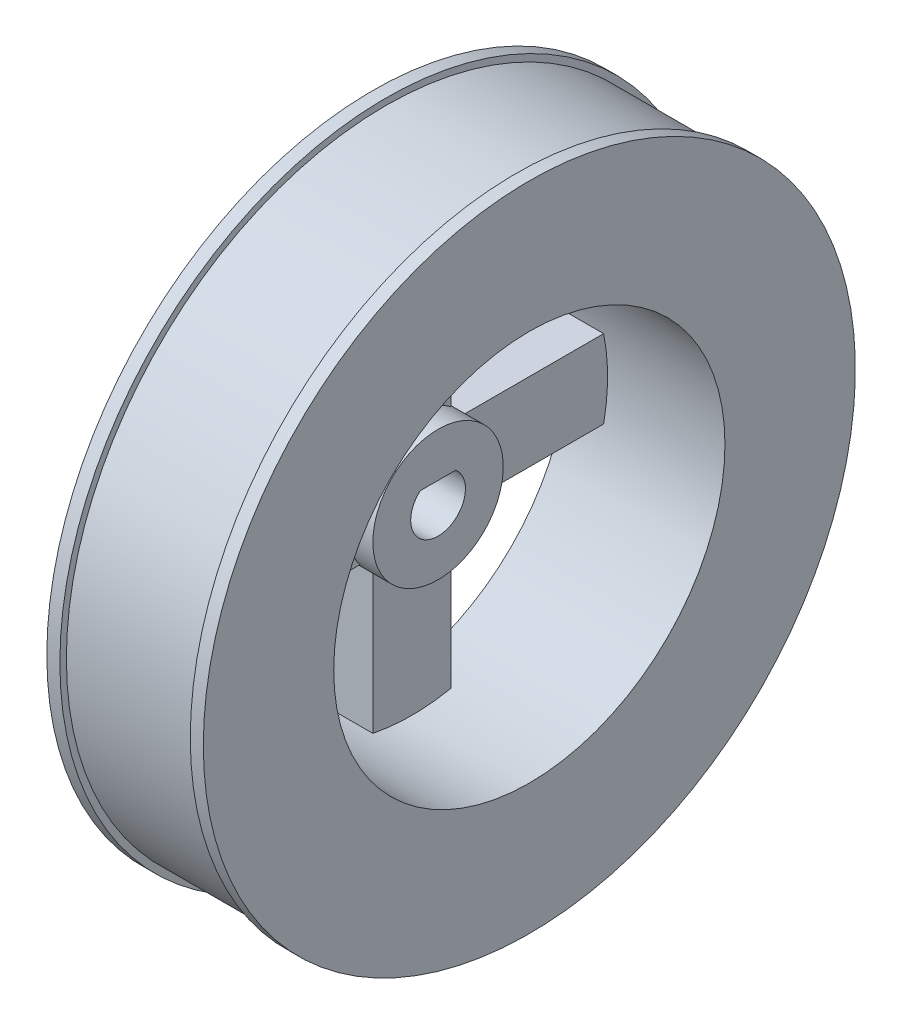
ISO-10303-21;
HEADER;
FILE_DESCRIPTION(('STEP AP214'),'2;1');
FILE_NAME('part.step','',(''),(''),'','','');
FILE_SCHEMA(('AUTOMOTIVE_DESIGN { 1 0 10303 214 1 1 1 1 }'));
ENDSEC;
DATA;
#1=APPLICATION_CONTEXT('core data for automotive mechanical design processes');
#2=APPLICATION_PROTOCOL_DEFINITION('international standard','automotive_design',2000,#1);
#3=PRODUCT_CONTEXT('',#1,'mechanical');
#4=PRODUCT('Part','Part','',(#3));
#5=PRODUCT_RELATED_PRODUCT_CATEGORY('part','',(#4));
#6=PRODUCT_DEFINITION_FORMATION('','',#4);
#7=PRODUCT_DEFINITION_CONTEXT('part definition',#1,'design');
#8=PRODUCT_DEFINITION('design','',#6,#7);
#9=PRODUCT_DEFINITION_SHAPE('','',#8);
#10=(LENGTH_UNIT() NAMED_UNIT(*) SI_UNIT(.MILLI.,.METRE.));
#11=(NAMED_UNIT(*) PLANE_ANGLE_UNIT() SI_UNIT($,.RADIAN.));
#12=(NAMED_UNIT(*) SI_UNIT($,.STERADIAN.) SOLID_ANGLE_UNIT());
#13=UNCERTAINTY_MEASURE_WITH_UNIT(LENGTH_MEASURE(1.E-05),#10,'distance_accuracy_value','');
#14=(GEOMETRIC_REPRESENTATION_CONTEXT(3) GLOBAL_UNCERTAINTY_ASSIGNED_CONTEXT((#13)) GLOBAL_UNIT_ASSIGNED_CONTEXT((#10,
#11,#12)) REPRESENTATION_CONTEXT('',''));
#15=CARTESIAN_POINT('',(0.,0.,0.));
#16=DIRECTION('',(0.,0.,1.));
#17=DIRECTION('',(1.,0.,0.));
#18=AXIS2_PLACEMENT_3D('',#15,#16,#17);
#19=CARTESIAN_POINT('',(0.,0.,0.));
#20=DIRECTION('',(-1.,0.,0.));
#21=DIRECTION('',(0.,0.,1.));
#22=AXIS2_PLACEMENT_3D('',#19,#20,#21);
#23=CYLINDRICAL_SURFACE('',#22,15.);
#24=CARTESIAN_POINT('',(6.00000000000001,0.,0.));
#25=DIRECTION('',(-1.,0.,0.));
#26=DIRECTION('',(0.,0.,1.));
#27=AXIS2_PLACEMENT_3D('',#24,#25,#26);
#28=CIRCLE('',#27,15.);
#29=CARTESIAN_POINT('',(6.00000000000001,0.,15.));
#30=VERTEX_POINT('',#29);
#31=EDGE_CURVE('E360',#30,#30,#28,.T.);
#32=ORIENTED_EDGE('',*,*,#31,.F.);
#33=EDGE_LOOP('',(#32));
#34=FACE_BOUND('',#33,.T.);
#35=DIRECTION('',(-1.,0.,0.));
#36=VECTOR('',#35,1.);
#37=CARTESIAN_POINT('',(-3.00000000000001,3.00000000000016,14.696938456699));
#38=LINE('',#37,#36);
#39=CARTESIAN_POINT('',(-3.00000000000001,3.00000000000016,14.696938456699));
#40=VERTEX_POINT('',#39);
#41=CARTESIAN_POINT('',(-6.00000000000001,3.00000000000016,14.696938456699));
#42=VERTEX_POINT('',#41);
#43=EDGE_CURVE('E178',#40,#42,#38,.T.);
#44=ORIENTED_EDGE('',*,*,#43,.T.);
#45=CARTESIAN_POINT('',(-6.00000000000001,0.,0.));
#46=DIRECTION('',(-1.,0.,0.));
#47=DIRECTION('',(0.,0.,1.));
#48=AXIS2_PLACEMENT_3D('',#45,#46,#47);
#49=CIRCLE('',#48,15.);
#50=CARTESIAN_POINT('',(-6.00000000000001,14.6969384566991,3.));
#51=VERTEX_POINT('',#50);
#52=EDGE_CURVE('E364',#42,#51,#49,.T.);
#53=ORIENTED_EDGE('',*,*,#52,.T.);
#54=DIRECTION('',(-1.,0.,0.));
#55=VECTOR('',#54,1.);
#56=CARTESIAN_POINT('',(-3.00000000000001,14.6969384566991,3.));
#57=LINE('',#56,#55);
#58=CARTESIAN_POINT('',(-3.00000000000001,14.6969384566991,3.));
#59=VERTEX_POINT('',#58);
#60=EDGE_CURVE('E328',#59,#51,#57,.T.);
#61=ORIENTED_EDGE('',*,*,#60,.F.);
#62=CARTESIAN_POINT('',(-3.00000000000001,0.,0.));
#63=DIRECTION('',(1.,0.,0.));
#64=DIRECTION('',(0.,0.,1.));
#65=AXIS2_PLACEMENT_3D('',#62,#63,#64);
#66=CIRCLE('',#65,15.);
#67=CARTESIAN_POINT('',(-3.00000000000001,14.6969384566991,-3.));
#68=VERTEX_POINT('',#67);
#69=EDGE_CURVE('E311',#68,#59,#66,.T.);
#70=ORIENTED_EDGE('',*,*,#69,.F.);
#71=DIRECTION('',(-1.,0.,0.));
#72=VECTOR('',#71,1.);
#73=CARTESIAN_POINT('',(-3.00000000000001,14.6969384566991,-3.));
#74=LINE('',#73,#72);
#75=CARTESIAN_POINT('',(-6.00000000000001,14.6969384566991,-3.));
#76=VERTEX_POINT('',#75);
#77=EDGE_CURVE('E332',#68,#76,#74,.T.);
#78=ORIENTED_EDGE('',*,*,#77,.T.);
#79=CARTESIAN_POINT('',(-6.00000000000001,2.99999999999994,-14.6969384566991));
#80=VERTEX_POINT('',#79);
#81=EDGE_CURVE('E365',#76,#80,#49,.T.);
#82=ORIENTED_EDGE('',*,*,#81,.T.);
#83=DIRECTION('',(-1.,0.,0.));
#84=VECTOR('',#83,1.);
#85=CARTESIAN_POINT('',(-3.00000000000001,2.99999999999995,-14.6969384566991));
#86=LINE('',#85,#84);
#87=CARTESIAN_POINT('',(-3.00000000000001,2.99999999999995,-14.6969384566991));
#88=VERTEX_POINT('',#87);
#89=EDGE_CURVE('E266',#88,#80,#86,.T.);
#90=ORIENTED_EDGE('',*,*,#89,.F.);
#91=CARTESIAN_POINT('',(-3.00000000000001,0.,0.));
#92=DIRECTION('',(1.,0.,0.));
#93=DIRECTION('',(0.,1.,0.));
#94=AXIS2_PLACEMENT_3D('',#91,#92,#93);
#95=CIRCLE('',#94,15.);
#96=CARTESIAN_POINT('',(-3.00000000000001,-3.00000000000005,-14.6969384566991));
#97=VERTEX_POINT('',#96);
#98=EDGE_CURVE('E250',#97,#88,#95,.T.);
#99=ORIENTED_EDGE('',*,*,#98,.F.);
#100=DIRECTION('',(-1.,0.,0.));
#101=VECTOR('',#100,1.);
#102=CARTESIAN_POINT('',(-3.00000000000001,-3.00000000000006,-14.6969384566991));
#103=LINE('',#102,#101);
#104=CARTESIAN_POINT('',(-6.00000000000001,-3.00000000000006,-14.6969384566991));
#105=VERTEX_POINT('',#104);
#106=EDGE_CURVE('E270',#97,#105,#103,.T.);
#107=ORIENTED_EDGE('',*,*,#106,.T.);
#108=CARTESIAN_POINT('',(-6.00000000000001,-14.6969384566991,-3.));
#109=VERTEX_POINT('',#108);
#110=EDGE_CURVE('E369',#105,#109,#49,.T.);
#111=ORIENTED_EDGE('',*,*,#110,.T.);
#112=DIRECTION('',(-1.,0.,0.));
#113=VECTOR('',#112,1.);
#114=CARTESIAN_POINT('',(-3.00000000000001,-14.6969384566991,-3.));
#115=LINE('',#114,#113);
#116=CARTESIAN_POINT('',(-3.00000000000001,-14.6969384566991,-3.));
#117=VERTEX_POINT('',#116);
#118=EDGE_CURVE('E229',#117,#109,#115,.T.);
#119=ORIENTED_EDGE('',*,*,#118,.F.);
#120=CARTESIAN_POINT('',(-3.00000000000001,0.,0.));
#121=DIRECTION('',(1.,0.,0.));
#122=DIRECTION('',(0.,0.,-1.));
#123=AXIS2_PLACEMENT_3D('',#120,#121,#122);
#124=CIRCLE('',#123,15.);
#125=CARTESIAN_POINT('',(-3.00000000000001,-14.6969384566991,3.));
#126=VERTEX_POINT('',#125);
#127=EDGE_CURVE('E216',#126,#117,#124,.T.);
#128=ORIENTED_EDGE('',*,*,#127,.F.);
#129=DIRECTION('',(-1.,0.,0.));
#130=VECTOR('',#129,1.);
#131=CARTESIAN_POINT('',(-3.00000000000001,-14.6969384566991,3.));
#132=LINE('',#131,#130);
#133=CARTESIAN_POINT('',(-6.00000000000001,-14.6969384566991,3.));
#134=VERTEX_POINT('',#133);
#135=EDGE_CURVE('E233',#126,#134,#132,.T.);
#136=ORIENTED_EDGE('',*,*,#135,.T.);
#137=CARTESIAN_POINT('',(-6.00000000000001,-2.99999999999984,14.6969384566991));
#138=VERTEX_POINT('',#137);
#139=EDGE_CURVE('E449',#134,#138,#49,.T.);
#140=ORIENTED_EDGE('',*,*,#139,.T.);
#141=DIRECTION('',(-1.,0.,0.));
#142=VECTOR('',#141,1.);
#143=CARTESIAN_POINT('',(-3.00000000000001,-2.99999999999984,14.6969384566991));
#144=LINE('',#143,#142);
#145=CARTESIAN_POINT('',(-3.00000000000001,-2.99999999999984,14.6969384566991));
#146=VERTEX_POINT('',#145);
#147=EDGE_CURVE('E68',#146,#138,#144,.T.);
#148=ORIENTED_EDGE('',*,*,#147,.F.);
#149=CARTESIAN_POINT('',(-3.00000000000001,0.,0.));
#150=DIRECTION('',(1.,0.,0.));
#151=DIRECTION('',(0.,-1.,0.));
#152=AXIS2_PLACEMENT_3D('',#149,#150,#151);
#153=CIRCLE('',#152,15.);
#154=EDGE_CURVE('E63',#40,#146,#153,.T.);
#155=ORIENTED_EDGE('',*,*,#154,.F.);
#156=EDGE_LOOP('',(#44,#53,#61,#70,#78,#82,#90,#99,#107,#111,#119,#128,#136,#140,#148,#155));
#157=FACE_BOUND('',#156,.T.);
#158=ADVANCED_FACE('F47',(#34,#157),#23,.F.);
#159=CARTESIAN_POINT('',(0.,0.,0.));
#160=DIRECTION('',(-1.,0.,0.));
#161=DIRECTION('',(0.,0.,1.));
#162=AXIS2_PLACEMENT_3D('',#159,#160,#161);
#163=CYLINDRICAL_SURFACE('',#162,5.);
#164=CARTESIAN_POINT('',(-0.999999999999997,0.,0.));
#165=DIRECTION('',(-1.,0.,0.));
#166=DIRECTION('',(0.,0.,1.));
#167=AXIS2_PLACEMENT_3D('',#164,#165,#166);
#168=CIRCLE('',#167,5.);
#169=CARTESIAN_POINT('',(-0.999999999999997,0.,5.));
#170=VERTEX_POINT('',#169);
#171=EDGE_CURVE('E296',#170,#170,#168,.T.);
#172=ORIENTED_EDGE('',*,*,#171,.T.);
#173=EDGE_LOOP('',(#172));
#174=FACE_BOUND('',#173,.T.);
#175=DIRECTION('',(-1.,0.,0.));
#176=VECTOR('',#175,1.);
#177=CARTESIAN_POINT('',(-3.00000000000001,3.00000000000004,3.99999999999997));
#178=LINE('',#177,#176);
#179=CARTESIAN_POINT('',(-3.00000000000001,3.00000000000004,3.99999999999997));
#180=VERTEX_POINT('',#179);
#181=CARTESIAN_POINT('',(-6.,3.00000000000004,3.99999999999997));
#182=VERTEX_POINT('',#181);
#183=EDGE_CURVE('E176',#180,#182,#178,.T.);
#184=ORIENTED_EDGE('',*,*,#183,.F.);
#185=CARTESIAN_POINT('',(-3.00000000000001,0.,0.));
#186=DIRECTION('',(-1.,0.,0.));
#187=DIRECTION('',(0.,1.,0.));
#188=AXIS2_PLACEMENT_3D('',#185,#186,#187);
#189=CIRCLE('',#188,5.);
#190=CARTESIAN_POINT('',(-3.00000000000001,-2.99999999999996,4.00000000000003));
#191=VERTEX_POINT('',#190);
#192=EDGE_CURVE('E181',#191,#180,#189,.T.);
#193=ORIENTED_EDGE('',*,*,#192,.F.);
#194=DIRECTION('',(-1.,0.,0.));
#195=VECTOR('',#194,1.);
#196=CARTESIAN_POINT('',(-3.00000000000001,-2.99999999999996,4.00000000000003));
#197=LINE('',#196,#195);
#198=CARTESIAN_POINT('',(-6.00000000000001,-2.99999999999996,4.00000000000003));
#199=VERTEX_POINT('',#198);
#200=EDGE_CURVE('E439',#191,#199,#197,.T.);
#201=ORIENTED_EDGE('',*,*,#200,.T.);
#202=CARTESIAN_POINT('',(-6.,0.,0.));
#203=DIRECTION('',(-1.,0.,0.));
#204=DIRECTION('',(0.,0.,1.));
#205=AXIS2_PLACEMENT_3D('',#202,#203,#204);
#206=CIRCLE('',#205,5.);
#207=CARTESIAN_POINT('',(-6.,-4.,3.));
#208=VERTEX_POINT('',#207);
#209=EDGE_CURVE('E451',#208,#199,#206,.T.);
#210=ORIENTED_EDGE('',*,*,#209,.F.);
#211=DIRECTION('',(-1.,0.,0.));
#212=VECTOR('',#211,1.);
#213=CARTESIAN_POINT('',(-3.00000000000001,-4.,3.));
#214=LINE('',#213,#212);
#215=CARTESIAN_POINT('',(-3.00000000000001,-4.,3.));
#216=VERTEX_POINT('',#215);
#217=EDGE_CURVE('E237',#216,#208,#214,.T.);
#218=ORIENTED_EDGE('',*,*,#217,.F.);
#219=CARTESIAN_POINT('',(-3.00000000000001,0.,0.));
#220=DIRECTION('',(-1.,0.,0.));
#221=DIRECTION('',(0.,0.,1.));
#222=AXIS2_PLACEMENT_3D('',#219,#220,#221);
#223=CIRCLE('',#222,5.);
#224=CARTESIAN_POINT('',(-3.00000000000001,-4.,-3.));
#225=VERTEX_POINT('',#224);
#226=EDGE_CURVE('E208',#225,#216,#223,.T.);
#227=ORIENTED_EDGE('',*,*,#226,.F.);
#228=DIRECTION('',(-1.,0.,0.));
#229=VECTOR('',#228,1.);
#230=CARTESIAN_POINT('',(-3.00000000000001,-4.,-3.));
#231=LINE('',#230,#229);
#232=CARTESIAN_POINT('',(-6.00000000000001,-4.,-3.));
#233=VERTEX_POINT('',#232);
#234=EDGE_CURVE('E222',#225,#233,#231,.T.);
#235=ORIENTED_EDGE('',*,*,#234,.T.);
#236=CARTESIAN_POINT('',(-6.,-3.00000000000002,-3.99999999999999));
#237=VERTEX_POINT('',#236);
#238=EDGE_CURVE('E297',#237,#233,#206,.T.);
#239=ORIENTED_EDGE('',*,*,#238,.F.);
#240=DIRECTION('',(-1.,0.,0.));
#241=VECTOR('',#240,1.);
#242=CARTESIAN_POINT('',(-3.00000000000001,-3.00000000000002,-3.99999999999999));
#243=LINE('',#242,#241);
#244=CARTESIAN_POINT('',(-3.00000000000001,-3.00000000000002,-3.99999999999999));
#245=VERTEX_POINT('',#244);
#246=EDGE_CURVE('E274',#245,#237,#243,.T.);
#247=ORIENTED_EDGE('',*,*,#246,.F.);
#248=CARTESIAN_POINT('',(-3.00000000000001,0.,0.));
#249=DIRECTION('',(-1.,0.,0.));
#250=DIRECTION('',(0.,-1.,0.));
#251=AXIS2_PLACEMENT_3D('',#248,#249,#250);
#252=CIRCLE('',#251,5.);
#253=CARTESIAN_POINT('',(-3.00000000000001,2.99999999999998,-4.00000000000001));
#254=VERTEX_POINT('',#253);
#255=EDGE_CURVE('E241',#254,#245,#252,.T.);
#256=ORIENTED_EDGE('',*,*,#255,.F.);
#257=DIRECTION('',(-1.,0.,0.));
#258=VECTOR('',#257,1.);
#259=CARTESIAN_POINT('',(-3.00000000000001,2.99999999999998,-4.00000000000001));
#260=LINE('',#259,#258);
#261=CARTESIAN_POINT('',(-6.00000000000001,2.99999999999998,-4.00000000000001));
#262=VERTEX_POINT('',#261);
#263=EDGE_CURVE('E257',#254,#262,#260,.T.);
#264=ORIENTED_EDGE('',*,*,#263,.T.);
#265=CARTESIAN_POINT('',(-6.,4.,-3.));
#266=VERTEX_POINT('',#265);
#267=EDGE_CURVE('E292',#266,#262,#206,.T.);
#268=ORIENTED_EDGE('',*,*,#267,.F.);
#269=DIRECTION('',(-1.,0.,0.));
#270=VECTOR('',#269,1.);
#271=CARTESIAN_POINT('',(-3.00000000000001,4.,-3.));
#272=LINE('',#271,#270);
#273=CARTESIAN_POINT('',(-3.00000000000001,4.,-3.));
#274=VERTEX_POINT('',#273);
#275=EDGE_CURVE('E336',#274,#266,#272,.T.);
#276=ORIENTED_EDGE('',*,*,#275,.F.);
#277=CARTESIAN_POINT('',(-3.00000000000001,0.,0.));
#278=DIRECTION('',(-1.,0.,0.));
#279=DIRECTION('',(0.,0.,-1.));
#280=AXIS2_PLACEMENT_3D('',#277,#278,#279);
#281=CIRCLE('',#280,5.);
#282=CARTESIAN_POINT('',(-3.00000000000001,4.,3.));
#283=VERTEX_POINT('',#282);
#284=EDGE_CURVE('E302',#283,#274,#281,.T.);
#285=ORIENTED_EDGE('',*,*,#284,.F.);
#286=DIRECTION('',(-1.,0.,0.));
#287=VECTOR('',#286,1.);
#288=CARTESIAN_POINT('',(-3.00000000000001,4.,3.));
#289=LINE('',#288,#287);
#290=CARTESIAN_POINT('',(-6.,4.,3.));
#291=VERTEX_POINT('',#290);
#292=EDGE_CURVE('E319',#283,#291,#289,.T.);
#293=ORIENTED_EDGE('',*,*,#292,.T.);
#294=EDGE_CURVE('E196',#182,#291,#206,.T.);
#295=ORIENTED_EDGE('',*,*,#294,.F.);
#296=EDGE_LOOP('',(#184,#193,#201,#210,#218,#227,#235,#239,#247,#256,#264,#268,#276,#285,#293,#295));
#297=FACE_BOUND('',#296,.T.);
#298=ADVANCED_FACE('F194',(#174,#297),#163,.T.);
#299=CARTESIAN_POINT('',(0.,0.,0.));
#300=DIRECTION('',(-1.,0.,0.));
#301=DIRECTION('',(0.,0.,1.));
#302=AXIS2_PLACEMENT_3D('',#299,#300,#301);
#303=CYLINDRICAL_SURFACE('',#302,25.);
#304=CARTESIAN_POINT('',(-6.,0.,0.));
#305=DIRECTION('',(-1.,0.,0.));
#306=DIRECTION('',(0.,0.,1.));
#307=AXIS2_PLACEMENT_3D('',#304,#305,#306);
#308=CIRCLE('',#307,25.);
#309=CARTESIAN_POINT('',(-6.,0.,25.));
#310=VERTEX_POINT('',#309);
#311=EDGE_CURVE('E368',#310,#310,#308,.T.);
#312=ORIENTED_EDGE('',*,*,#311,.F.);
#313=EDGE_LOOP('',(#312));
#314=FACE_BOUND('',#313,.T.);
#315=CARTESIAN_POINT('',(-5.,0.,0.));
#316=DIRECTION('',(-1.,0.,0.));
#317=DIRECTION('',(0.,0.,1.));
#318=AXIS2_PLACEMENT_3D('',#315,#316,#317);
#319=CIRCLE('',#318,25.);
#320=CARTESIAN_POINT('',(-5.,0.,25.));
#321=VERTEX_POINT('',#320);
#322=EDGE_CURVE('E340',#321,#321,#319,.T.);
#323=ORIENTED_EDGE('',*,*,#322,.T.);
#324=EDGE_LOOP('',(#323));
#325=FACE_BOUND('',#324,.T.);
#326=ADVANCED_FACE('F49',(#314,#325),#303,.T.);
#327=CARTESIAN_POINT('',(-6.00000000000001,25.,0.));
#328=DIRECTION('',(1.,0.,0.));
#329=DIRECTION('',(0.,0.,-1.));
#330=AXIS2_PLACEMENT_3D('',#327,#328,#329);
#331=PLANE('',#330);
#332=DIRECTION('',(0.,0.,1.));
#333=VECTOR('',#332,1.);
#334=CARTESIAN_POINT('',(-6.00000000000001,3.00000000000004,3.99999999999997));
#335=LINE('',#334,#333);
#336=EDGE_CURVE('E431',#182,#42,#335,.T.);
#337=ORIENTED_EDGE('',*,*,#336,.F.);
#338=ORIENTED_EDGE('',*,*,#294,.T.);
#339=DIRECTION('',(0.,-1.,0.));
#340=VECTOR('',#339,1.);
#341=CARTESIAN_POINT('',(-6.00000000000001,4.,3.));
#342=LINE('',#341,#340);
#343=EDGE_CURVE('E307',#51,#291,#342,.T.);
#344=ORIENTED_EDGE('',*,*,#343,.F.);
#345=ORIENTED_EDGE('',*,*,#52,.F.);
#346=EDGE_LOOP('',(#337,#338,#344,#345));
#347=FACE_BOUND('',#346,.T.);
#348=DIRECTION('',(0.,-1.,0.));
#349=VECTOR('',#348,1.);
#350=CARTESIAN_POINT('',(-6.00000000000001,-4.,3.));
#351=LINE('',#350,#349);
#352=EDGE_CURVE('E198',#208,#134,#351,.T.);
#353=ORIENTED_EDGE('',*,*,#352,.F.);
#354=ORIENTED_EDGE('',*,*,#209,.T.);
#355=DIRECTION('',(0.,0.,-1.));
#356=VECTOR('',#355,1.);
#357=CARTESIAN_POINT('',(-6.00000000000001,-2.99999999999996,4.00000000000003));
#358=LINE('',#357,#356);
#359=EDGE_CURVE('E191',#138,#199,#358,.T.);
#360=ORIENTED_EDGE('',*,*,#359,.F.);
#361=ORIENTED_EDGE('',*,*,#139,.F.);
#362=EDGE_LOOP('',(#353,#354,#360,#361));
#363=FACE_BOUND('',#362,.T.);
#364=DIRECTION('',(0.,0.,1.));
#365=VECTOR('',#364,1.);
#366=CARTESIAN_POINT('',(-6.00000000000001,2.99999999999998,-4.00000000000001));
#367=LINE('',#366,#365);
#368=EDGE_CURVE('E246',#80,#262,#367,.T.);
#369=ORIENTED_EDGE('',*,*,#368,.F.);
#370=ORIENTED_EDGE('',*,*,#81,.F.);
#371=DIRECTION('',(0.,1.,0.));
#372=VECTOR('',#371,1.);
#373=CARTESIAN_POINT('',(-6.00000000000001,4.,-3.));
#374=LINE('',#373,#372);
#375=EDGE_CURVE('E301',#266,#76,#374,.T.);
#376=ORIENTED_EDGE('',*,*,#375,.F.);
#377=ORIENTED_EDGE('',*,*,#267,.T.);
#378=EDGE_LOOP('',(#369,#370,#376,#377));
#379=FACE_BOUND('',#378,.T.);
#380=DIRECTION('',(0.,0.,1.));
#381=VECTOR('',#380,1.);
#382=CARTESIAN_POINT('',(-6.00000000000001,1.6,1.36014705087354));
#383=LINE('',#382,#381);
#384=CARTESIAN_POINT('',(-6.00000000000001,1.6,-1.36014705087354));
#385=VERTEX_POINT('',#384);
#386=CARTESIAN_POINT('',(-6.00000000000001,1.6,1.36014705087354));
#387=VERTEX_POINT('',#386);
#388=EDGE_CURVE('E281',#385,#387,#383,.T.);
#389=ORIENTED_EDGE('',*,*,#388,.T.);
#390=CARTESIAN_POINT('',(-6.00000000000001,0.,0.));
#391=DIRECTION('',(1.,0.,0.));
#392=DIRECTION('',(0.,0.,-1.));
#393=AXIS2_PLACEMENT_3D('',#390,#391,#392);
#394=CIRCLE('',#393,2.1);
#395=EDGE_CURVE('E277',#387,#385,#394,.T.);
#396=ORIENTED_EDGE('',*,*,#395,.T.);
#397=EDGE_LOOP('',(#389,#396));
#398=FACE_BOUND('',#397,.T.);
#399=ORIENTED_EDGE('',*,*,#110,.F.);
#400=DIRECTION('',(0.,0.,-1.));
#401=VECTOR('',#400,1.);
#402=CARTESIAN_POINT('',(-6.00000000000001,-3.00000000000002,-3.99999999999999));
#403=LINE('',#402,#401);
#404=EDGE_CURVE('E240',#237,#105,#403,.T.);
#405=ORIENTED_EDGE('',*,*,#404,.F.);
#406=ORIENTED_EDGE('',*,*,#238,.T.);
#407=DIRECTION('',(0.,1.,0.));
#408=VECTOR('',#407,1.);
#409=CARTESIAN_POINT('',(-6.00000000000001,-4.,-3.));
#410=LINE('',#409,#408);
#411=EDGE_CURVE('E203',#109,#233,#410,.T.);
#412=ORIENTED_EDGE('',*,*,#411,.F.);
#413=EDGE_LOOP('',(#399,#405,#406,#412));
#414=FACE_BOUND('',#413,.T.);
#415=ORIENTED_EDGE('',*,*,#311,.T.);
#416=EDGE_LOOP('',(#415));
#417=FACE_BOUND('',#416,.T.);
#418=ADVANCED_FACE('F385',(#347,#363,#379,#398,#414,#417),#331,.F.);
#419=CARTESIAN_POINT('',(6.00000000000001,15.,0.));
#420=DIRECTION('',(-1.,0.,0.));
#421=DIRECTION('',(0.,0.,1.));
#422=AXIS2_PLACEMENT_3D('',#419,#420,#421);
#423=PLANE('',#422);
#424=CARTESIAN_POINT('',(6.,0.,0.));
#425=DIRECTION('',(-1.,0.,0.));
#426=DIRECTION('',(0.,0.,1.));
#427=AXIS2_PLACEMENT_3D('',#424,#425,#426);
#428=CIRCLE('',#427,25.);
#429=CARTESIAN_POINT('',(6.,0.,25.));
#430=VERTEX_POINT('',#429);
#431=EDGE_CURVE('E356',#430,#430,#428,.T.);
#432=ORIENTED_EDGE('',*,*,#431,.F.);
#433=EDGE_LOOP('',(#432));
#434=FACE_BOUND('',#433,.T.);
#435=ORIENTED_EDGE('',*,*,#31,.T.);
#436=EDGE_LOOP('',(#435));
#437=FACE_BOUND('',#436,.T.);
#438=ADVANCED_FACE('F388',(#434,#437),#423,.F.);
#439=CARTESIAN_POINT('',(0.,0.,0.));
#440=DIRECTION('',(-1.,0.,0.));
#441=DIRECTION('',(0.,0.,1.));
#442=AXIS2_PLACEMENT_3D('',#439,#440,#441);
#443=CYLINDRICAL_SURFACE('',#442,25.);
#444=CARTESIAN_POINT('',(5.,0.,0.));
#445=DIRECTION('',(-1.,0.,0.));
#446=DIRECTION('',(0.,0.,1.));
#447=AXIS2_PLACEMENT_3D('',#444,#445,#446);
#448=CIRCLE('',#447,25.);
#449=CARTESIAN_POINT('',(5.,0.,25.));
#450=VERTEX_POINT('',#449);
#451=EDGE_CURVE('E352',#450,#450,#448,.T.);
#452=ORIENTED_EDGE('',*,*,#451,.F.);
#453=EDGE_LOOP('',(#452));
#454=FACE_BOUND('',#453,.T.);
#455=ORIENTED_EDGE('',*,*,#431,.T.);
#456=EDGE_LOOP('',(#455));
#457=FACE_BOUND('',#456,.T.);
#458=ADVANCED_FACE('F415',(#454,#457),#443,.T.);
#459=CARTESIAN_POINT('',(5.,25.,0.));
#460=DIRECTION('',(1.,0.,0.));
#461=DIRECTION('',(0.,0.,-1.));
#462=AXIS2_PLACEMENT_3D('',#459,#460,#461);
#463=PLANE('',#462);
#464=CARTESIAN_POINT('',(5.,0.,0.));
#465=DIRECTION('',(-1.,0.,0.));
#466=DIRECTION('',(0.,0.,1.));
#467=AXIS2_PLACEMENT_3D('',#464,#465,#466);
#468=CIRCLE('',#467,24.5);
#469=CARTESIAN_POINT('',(5.,0.,24.5));
#470=VERTEX_POINT('',#469);
#471=EDGE_CURVE('E348',#470,#470,#468,.T.);
#472=ORIENTED_EDGE('',*,*,#471,.F.);
#473=EDGE_LOOP('',(#472));
#474=FACE_BOUND('',#473,.T.);
#475=ORIENTED_EDGE('',*,*,#451,.T.);
#476=EDGE_LOOP('',(#475));
#477=FACE_BOUND('',#476,.T.);
#478=ADVANCED_FACE('F409',(#474,#477),#463,.F.);
#479=CARTESIAN_POINT('',(0.,0.,0.));
#480=DIRECTION('',(-1.,0.,0.));
#481=DIRECTION('',(0.,0.,1.));
#482=AXIS2_PLACEMENT_3D('',#479,#480,#481);
#483=CYLINDRICAL_SURFACE('',#482,24.5);
#484=CARTESIAN_POINT('',(-5.,0.,0.));
#485=DIRECTION('',(-1.,0.,0.));
#486=DIRECTION('',(0.,0.,1.));
#487=AXIS2_PLACEMENT_3D('',#484,#485,#486);
#488=CIRCLE('',#487,24.5);
#489=CARTESIAN_POINT('',(-5.,0.,24.5));
#490=VERTEX_POINT('',#489);
#491=EDGE_CURVE('E344',#490,#490,#488,.T.);
#492=ORIENTED_EDGE('',*,*,#491,.F.);
#493=EDGE_LOOP('',(#492));
#494=FACE_BOUND('',#493,.T.);
#495=ORIENTED_EDGE('',*,*,#471,.T.);
#496=EDGE_LOOP('',(#495));
#497=FACE_BOUND('',#496,.T.);
#498=ADVANCED_FACE('F403',(#494,#497),#483,.T.);
#499=CARTESIAN_POINT('',(-5.,24.5,0.));
#500=DIRECTION('',(-1.,0.,0.));
#501=DIRECTION('',(0.,0.,1.));
#502=AXIS2_PLACEMENT_3D('',#499,#500,#501);
#503=PLANE('',#502);
#504=ORIENTED_EDGE('',*,*,#322,.F.);
#505=EDGE_LOOP('',(#504));
#506=FACE_BOUND('',#505,.T.);
#507=ORIENTED_EDGE('',*,*,#491,.T.);
#508=EDGE_LOOP('',(#507));
#509=FACE_BOUND('',#508,.T.);
#510=ADVANCED_FACE('F399',(#506,#509),#503,.F.);
#511=CARTESIAN_POINT('',(-3.00000000000001,4.,-3.));
#512=DIRECTION('',(0.,0.,1.));
#513=DIRECTION('',(1.,0.,0.));
#514=AXIS2_PLACEMENT_3D('',#511,#512,#513);
#515=PLANE('',#514);
#516=ORIENTED_EDGE('',*,*,#375,.T.);
#517=ORIENTED_EDGE('',*,*,#77,.F.);
#518=DIRECTION('',(0.,1.,0.));
#519=VECTOR('',#518,1.);
#520=CARTESIAN_POINT('',(-3.00000000000001,4.,-3.));
#521=LINE('',#520,#519);
#522=EDGE_CURVE('E306',#274,#68,#521,.T.);
#523=ORIENTED_EDGE('',*,*,#522,.F.);
#524=ORIENTED_EDGE('',*,*,#275,.T.);
#525=EDGE_LOOP('',(#516,#517,#523,#524));
#526=FACE_BOUND('',#525,.T.);
#527=ADVANCED_FACE('F402',(#526),#515,.F.);
#528=CARTESIAN_POINT('',(-3.00000000000001,4.,3.));
#529=DIRECTION('',(0.,0.,-1.));
#530=DIRECTION('',(-1.,0.,0.));
#531=AXIS2_PLACEMENT_3D('',#528,#529,#530);
#532=PLANE('',#531);
#533=ORIENTED_EDGE('',*,*,#343,.T.);
#534=ORIENTED_EDGE('',*,*,#292,.F.);
#535=DIRECTION('',(0.,-1.,0.));
#536=VECTOR('',#535,1.);
#537=CARTESIAN_POINT('',(-3.00000000000001,4.,3.));
#538=LINE('',#537,#536);
#539=EDGE_CURVE('E315',#59,#283,#538,.T.);
#540=ORIENTED_EDGE('',*,*,#539,.F.);
#541=ORIENTED_EDGE('',*,*,#60,.T.);
#542=EDGE_LOOP('',(#533,#534,#540,#541));
#543=FACE_BOUND('',#542,.T.);
#544=ADVANCED_FACE('F461',(#543),#532,.F.);
#545=CARTESIAN_POINT('',(-3.00000000000001,0.,0.));
#546=DIRECTION('',(1.,0.,0.));
#547=DIRECTION('',(0.,0.,-1.));
#548=AXIS2_PLACEMENT_3D('',#545,#546,#547);
#549=PLANE('',#548);
#550=ORIENTED_EDGE('',*,*,#284,.T.);
#551=ORIENTED_EDGE('',*,*,#522,.T.);
#552=ORIENTED_EDGE('',*,*,#69,.T.);
#553=ORIENTED_EDGE('',*,*,#539,.T.);
#554=EDGE_LOOP('',(#550,#551,#552,#553));
#555=FACE_BOUND('',#554,.T.);
#556=ADVANCED_FACE('F463',(#555),#549,.T.);
#557=CARTESIAN_POINT('',(-0.999999999999997,0.,0.));
#558=DIRECTION('',(-1.,0.,0.));
#559=DIRECTION('',(0.,0.,1.));
#560=AXIS2_PLACEMENT_3D('',#557,#558,#559);
#561=PLANE('',#560);
#562=DIRECTION('',(0.,0.,-1.));
#563=VECTOR('',#562,1.);
#564=CARTESIAN_POINT('',(-0.999999999999997,1.6,0.));
#565=LINE('',#564,#563);
#566=CARTESIAN_POINT('',(-0.999999999999997,1.6,1.36014705087354));
#567=VERTEX_POINT('',#566);
#568=CARTESIAN_POINT('',(-0.999999999999997,1.6,-1.36014705087354));
#569=VERTEX_POINT('',#568);
#570=EDGE_CURVE('E56',#567,#569,#565,.T.);
#571=ORIENTED_EDGE('',*,*,#570,.T.);
#572=CARTESIAN_POINT('',(-0.999999999999997,0.,0.));
#573=DIRECTION('',(-1.,0.,0.));
#574=DIRECTION('',(0.,0.,1.));
#575=AXIS2_PLACEMENT_3D('',#572,#573,#574);
#576=CIRCLE('',#575,2.1);
#577=EDGE_CURVE('E11',#569,#567,#576,.T.);
#578=ORIENTED_EDGE('',*,*,#577,.T.);
#579=EDGE_LOOP('',(#571,#578));
#580=FACE_BOUND('',#579,.T.);
#581=ORIENTED_EDGE('',*,*,#171,.F.);
#582=EDGE_LOOP('',(#581));
#583=FACE_BOUND('',#582,.T.);
#584=ADVANCED_FACE('F375',(#580,#583),#561,.F.);
#585=CARTESIAN_POINT('',(-6.00000000000001,0.,0.));
#586=DIRECTION('',(1.,0.,0.));
#587=DIRECTION('',(0.,0.,-1.));
#588=AXIS2_PLACEMENT_3D('',#585,#586,#587);
#589=CYLINDRICAL_SURFACE('',#588,2.1);
#590=DIRECTION('',(1.,0.,0.));
#591=VECTOR('',#590,1.);
#592=CARTESIAN_POINT('',(-6.00000000000001,1.6,-1.36014705087354));
#593=LINE('',#592,#591);
#594=EDGE_CURVE('E285',#385,#569,#593,.T.);
#595=ORIENTED_EDGE('',*,*,#594,.F.);
#596=ORIENTED_EDGE('',*,*,#395,.F.);
#597=DIRECTION('',(1.,0.,0.));
#598=VECTOR('',#597,1.);
#599=CARTESIAN_POINT('',(-6.00000000000001,1.6,1.36014705087354));
#600=LINE('',#599,#598);
#601=EDGE_CURVE('E286',#387,#567,#600,.T.);
#602=ORIENTED_EDGE('',*,*,#601,.T.);
#603=ORIENTED_EDGE('',*,*,#577,.F.);
#604=EDGE_LOOP('',(#595,#596,#602,#603));
#605=FACE_BOUND('',#604,.T.);
#606=ADVANCED_FACE('F383',(#605),#589,.F.);
#607=CARTESIAN_POINT('',(-6.00000000000001,1.6,1.36014705087354));
#608=DIRECTION('',(0.,1.,0.));
#609=DIRECTION('',(0.,0.,1.));
#610=AXIS2_PLACEMENT_3D('',#607,#608,#609);
#611=PLANE('',#610);
#612=ORIENTED_EDGE('',*,*,#601,.F.);
#613=ORIENTED_EDGE('',*,*,#388,.F.);
#614=ORIENTED_EDGE('',*,*,#594,.T.);
#615=ORIENTED_EDGE('',*,*,#570,.F.);
#616=EDGE_LOOP('',(#612,#613,#614,#615));
#617=FACE_BOUND('',#616,.T.);
#618=ADVANCED_FACE('F380',(#617),#611,.F.);
#619=CARTESIAN_POINT('',(-3.00000000000001,-3.00000000000002,-3.99999999999999));
#620=DIRECTION('',(0.,1.,0.));
#621=DIRECTION('',(0.,0.,1.));
#622=AXIS2_PLACEMENT_3D('',#619,#620,#621);
#623=PLANE('',#622);
#624=ORIENTED_EDGE('',*,*,#404,.T.);
#625=ORIENTED_EDGE('',*,*,#106,.F.);
#626=DIRECTION('',(0.,0.,-1.));
#627=VECTOR('',#626,1.);
#628=CARTESIAN_POINT('',(-3.00000000000001,-3.00000000000002,-3.99999999999999));
#629=LINE('',#628,#627);
#630=EDGE_CURVE('E245',#245,#97,#629,.T.);
#631=ORIENTED_EDGE('',*,*,#630,.F.);
#632=ORIENTED_EDGE('',*,*,#246,.T.);
#633=EDGE_LOOP('',(#624,#625,#631,#632));
#634=FACE_BOUND('',#633,.T.);
#635=ADVANCED_FACE('F480',(#634),#623,.F.);
#636=CARTESIAN_POINT('',(-3.00000000000001,2.99999999999998,-4.00000000000001));
#637=DIRECTION('',(0.,-1.,0.));
#638=DIRECTION('',(0.,0.,-1.));
#639=AXIS2_PLACEMENT_3D('',#636,#637,#638);
#640=PLANE('',#639);
#641=ORIENTED_EDGE('',*,*,#368,.T.);
#642=ORIENTED_EDGE('',*,*,#263,.F.);
#643=DIRECTION('',(0.,0.,1.));
#644=VECTOR('',#643,1.);
#645=CARTESIAN_POINT('',(-3.00000000000001,2.99999999999998,-4.00000000000001));
#646=LINE('',#645,#644);
#647=EDGE_CURVE('E254',#88,#254,#646,.T.);
#648=ORIENTED_EDGE('',*,*,#647,.F.);
#649=ORIENTED_EDGE('',*,*,#89,.T.);
#650=EDGE_LOOP('',(#641,#642,#648,#649));
#651=FACE_BOUND('',#650,.T.);
#652=ADVANCED_FACE('F471',(#651),#640,.F.);
#653=CARTESIAN_POINT('',(-3.00000000000001,0.,0.));
#654=DIRECTION('',(1.,0.,0.));
#655=DIRECTION('',(0.,-1.,0.));
#656=AXIS2_PLACEMENT_3D('',#653,#654,#655);
#657=PLANE('',#656);
#658=ORIENTED_EDGE('',*,*,#255,.T.);
#659=ORIENTED_EDGE('',*,*,#630,.T.);
#660=ORIENTED_EDGE('',*,*,#98,.T.);
#661=ORIENTED_EDGE('',*,*,#647,.T.);
#662=EDGE_LOOP('',(#658,#659,#660,#661));
#663=FACE_BOUND('',#662,.T.);
#664=ADVANCED_FACE('F477',(#663),#657,.T.);
#665=CARTESIAN_POINT('',(-3.00000000000001,-4.,3.));
#666=DIRECTION('',(0.,0.,-1.));
#667=DIRECTION('',(-1.,0.,0.));
#668=AXIS2_PLACEMENT_3D('',#665,#666,#667);
#669=PLANE('',#668);
#670=ORIENTED_EDGE('',*,*,#352,.T.);
#671=ORIENTED_EDGE('',*,*,#135,.F.);
#672=DIRECTION('',(0.,-1.,0.));
#673=VECTOR('',#672,1.);
#674=CARTESIAN_POINT('',(-3.00000000000001,-4.,3.));
#675=LINE('',#674,#673);
#676=EDGE_CURVE('E212',#216,#126,#675,.T.);
#677=ORIENTED_EDGE('',*,*,#676,.F.);
#678=ORIENTED_EDGE('',*,*,#217,.T.);
#679=EDGE_LOOP('',(#670,#671,#677,#678));
#680=FACE_BOUND('',#679,.T.);
#681=ADVANCED_FACE('F490',(#680),#669,.F.);
#682=CARTESIAN_POINT('',(-3.00000000000001,-4.,-3.));
#683=DIRECTION('',(0.,0.,1.));
#684=DIRECTION('',(1.,0.,0.));
#685=AXIS2_PLACEMENT_3D('',#682,#683,#684);
#686=PLANE('',#685);
#687=ORIENTED_EDGE('',*,*,#411,.T.);
#688=ORIENTED_EDGE('',*,*,#234,.F.);
#689=DIRECTION('',(0.,1.,0.));
#690=VECTOR('',#689,1.);
#691=CARTESIAN_POINT('',(-3.00000000000001,-4.,-3.));
#692=LINE('',#691,#690);
#693=EDGE_CURVE('E220',#117,#225,#692,.T.);
#694=ORIENTED_EDGE('',*,*,#693,.F.);
#695=ORIENTED_EDGE('',*,*,#118,.T.);
#696=EDGE_LOOP('',(#687,#688,#694,#695));
#697=FACE_BOUND('',#696,.T.);
#698=ADVANCED_FACE('F485',(#697),#686,.F.);
#699=CARTESIAN_POINT('',(-3.00000000000001,0.,0.));
#700=DIRECTION('',(1.,0.,0.));
#701=DIRECTION('',(0.,0.,1.));
#702=AXIS2_PLACEMENT_3D('',#699,#700,#701);
#703=PLANE('',#702);
#704=ORIENTED_EDGE('',*,*,#226,.T.);
#705=ORIENTED_EDGE('',*,*,#676,.T.);
#706=ORIENTED_EDGE('',*,*,#127,.T.);
#707=ORIENTED_EDGE('',*,*,#693,.T.);
#708=EDGE_LOOP('',(#704,#705,#706,#707));
#709=FACE_BOUND('',#708,.T.);
#710=ADVANCED_FACE('F487',(#709),#703,.T.);
#711=CARTESIAN_POINT('',(-3.00000000000001,3.00000000000004,3.99999999999997));
#712=DIRECTION('',(0.,-1.,0.));
#713=DIRECTION('',(0.,0.,-1.));
#714=AXIS2_PLACEMENT_3D('',#711,#712,#713);
#715=PLANE('',#714);
#716=ORIENTED_EDGE('',*,*,#336,.T.);
#717=ORIENTED_EDGE('',*,*,#43,.F.);
#718=DIRECTION('',(0.,0.,1.));
#719=VECTOR('',#718,1.);
#720=CARTESIAN_POINT('',(-3.00000000000001,3.00000000000004,3.99999999999997));
#721=LINE('',#720,#719);
#722=EDGE_CURVE('E171',#180,#40,#721,.T.);
#723=ORIENTED_EDGE('',*,*,#722,.F.);
#724=ORIENTED_EDGE('',*,*,#183,.T.);
#725=EDGE_LOOP('',(#716,#717,#723,#724));
#726=FACE_BOUND('',#725,.T.);
#727=ADVANCED_FACE('F174',(#726),#715,.F.);
#728=CARTESIAN_POINT('',(-3.00000000000001,-2.99999999999996,4.00000000000003));
#729=DIRECTION('',(0.,1.,0.));
#730=DIRECTION('',(0.,0.,1.));
#731=AXIS2_PLACEMENT_3D('',#728,#729,#730);
#732=PLANE('',#731);
#733=ORIENTED_EDGE('',*,*,#359,.T.);
#734=ORIENTED_EDGE('',*,*,#200,.F.);
#735=DIRECTION('',(0.,0.,-1.));
#736=VECTOR('',#735,1.);
#737=CARTESIAN_POINT('',(-3.00000000000001,-2.99999999999996,4.00000000000003));
#738=LINE('',#737,#736);
#739=EDGE_CURVE('E186',#146,#191,#738,.T.);
#740=ORIENTED_EDGE('',*,*,#739,.F.);
#741=ORIENTED_EDGE('',*,*,#147,.T.);
#742=EDGE_LOOP('',(#733,#734,#740,#741));
#743=FACE_BOUND('',#742,.T.);
#744=ADVANCED_FACE('F444',(#743),#732,.F.);
#745=CARTESIAN_POINT('',(-3.00000000000001,0.,0.));
#746=DIRECTION('',(1.,0.,0.));
#747=DIRECTION('',(0.,1.,0.));
#748=AXIS2_PLACEMENT_3D('',#745,#746,#747);
#749=PLANE('',#748);
#750=ORIENTED_EDGE('',*,*,#192,.T.);
#751=ORIENTED_EDGE('',*,*,#722,.T.);
#752=ORIENTED_EDGE('',*,*,#154,.T.);
#753=ORIENTED_EDGE('',*,*,#739,.T.);
#754=EDGE_LOOP('',(#750,#751,#752,#753));
#755=FACE_BOUND('',#754,.T.);
#756=ADVANCED_FACE('F184',(#755),#749,.T.);
#757=CLOSED_SHELL('',(#158,#298,#326,#418,#438,#458,#478,#498,#510,#527,#544,#556,#584,#606,
#618,#635,#652,#664,#681,#698,#710,#727,#744,#756));
#758=MANIFOLD_SOLID_BREP('B2',#757);
#759=ADVANCED_BREP_SHAPE_REPRESENTATION('',(#18,#758),#14);
#760=SHAPE_DEFINITION_REPRESENTATION(#9,#759);
ENDSEC;
END-ISO-10303-21;
